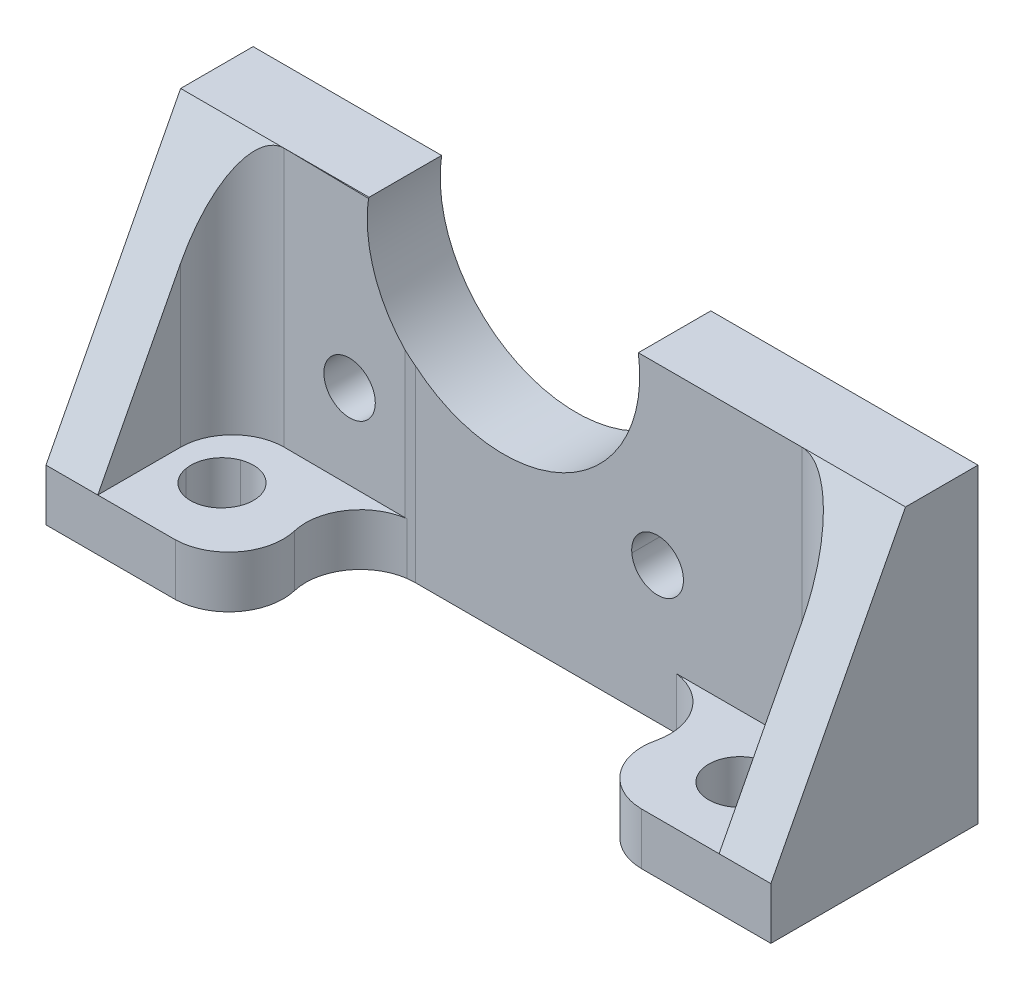
ISO-10303-21;
HEADER;
FILE_DESCRIPTION(('STEP AP214'),'2;1');
FILE_NAME('part.step','',(''),(''),'','','');
FILE_SCHEMA(('AUTOMOTIVE_DESIGN { 1 0 10303 214 1 1 1 1 }'));
ENDSEC;
DATA;
#1=APPLICATION_CONTEXT('core data for automotive mechanical design processes');
#2=APPLICATION_PROTOCOL_DEFINITION('international standard','automotive_design',2000,#1);
#3=PRODUCT_CONTEXT('',#1,'mechanical');
#4=PRODUCT('Part','Part','',(#3));
#5=PRODUCT_RELATED_PRODUCT_CATEGORY('part','',(#4));
#6=PRODUCT_DEFINITION_FORMATION('','',#4);
#7=PRODUCT_DEFINITION_CONTEXT('part definition',#1,'design');
#8=PRODUCT_DEFINITION('design','',#6,#7);
#9=PRODUCT_DEFINITION_SHAPE('','',#8);
#10=(LENGTH_UNIT() NAMED_UNIT(*) SI_UNIT(.MILLI.,.METRE.));
#11=(NAMED_UNIT(*) PLANE_ANGLE_UNIT() SI_UNIT($,.RADIAN.));
#12=(NAMED_UNIT(*) SI_UNIT($,.STERADIAN.) SOLID_ANGLE_UNIT());
#13=UNCERTAINTY_MEASURE_WITH_UNIT(LENGTH_MEASURE(1.E-05),#10,'distance_accuracy_value','');
#14=(GEOMETRIC_REPRESENTATION_CONTEXT(3) GLOBAL_UNCERTAINTY_ASSIGNED_CONTEXT((#13)) GLOBAL_UNIT_ASSIGNED_CONTEXT((#10,
#11,#12)) REPRESENTATION_CONTEXT('',''));
#15=CARTESIAN_POINT('',(0.,0.,0.));
#16=DIRECTION('',(0.,0.,1.));
#17=DIRECTION('',(1.,0.,0.));
#18=AXIS2_PLACEMENT_3D('',#15,#16,#17);
#19=CARTESIAN_POINT('',(0.534106042066399,30.,8.40733061908088));
#20=DIRECTION('',(0.0634008013396327,0.,0.997988145415311));
#21=DIRECTION('',(0.997988145415311,0.,-0.0634008013396327));
#22=AXIS2_PLACEMENT_3D('',#19,#20,#21);
#23=PLANE('',#22);
#24=DIRECTION('',(-0.997988145415311,0.,0.0634008013396327));
#25=VECTOR('',#24,1.);
#26=CARTESIAN_POINT('',(0.534106042066399,5.,8.40733061908088));
#27=LINE('',#26,#25);
#28=CARTESIAN_POINT('',(21.9298305014627,5.,7.04808994853845));
#29=VERTEX_POINT('',#28);
#30=CARTESIAN_POINT('',(21.7178268432617,5.,7.06155824661255));
#31=VERTEX_POINT('',#30);
#32=EDGE_CURVE('E165',#29,#31,#27,.T.);
#33=ORIENTED_EDGE('',*,*,#32,.F.);
#34=DIRECTION('',(0.,-1.,0.));
#35=VECTOR('',#34,1.);
#36=CARTESIAN_POINT('',(21.9298305014627,5.,7.04808994853845));
#37=LINE('',#36,#35);
#38=CARTESIAN_POINT('',(21.9298305014627,0.,7.04808994853845));
#39=VERTEX_POINT('',#38);
#40=EDGE_CURVE('E516',#29,#39,#37,.T.);
#41=ORIENTED_EDGE('',*,*,#40,.T.);
#42=DIRECTION('',(-0.997988145415311,0.,0.0634008013396327));
#43=VECTOR('',#42,1.);
#44=CARTESIAN_POINT('',(0.534106042066399,0.,8.40733061908088));
#45=LINE('',#44,#43);
#46=CARTESIAN_POINT('',(22.6868114471436,0.,7.));
#47=VERTEX_POINT('',#46);
#48=EDGE_CURVE('E474',#47,#39,#45,.T.);
#49=ORIENTED_EDGE('',*,*,#48,.F.);
#50=DIRECTION('',(0.,-1.,0.));
#51=VECTOR('',#50,1.);
#52=CARTESIAN_POINT('',(22.6868114471436,30.,7.));
#53=LINE('',#52,#51);
#54=CARTESIAN_POINT('',(22.6868114471436,18.13283074007,7.));
#55=VERTEX_POINT('',#54);
#56=EDGE_CURVE('E464',#55,#47,#53,.T.);
#57=ORIENTED_EDGE('',*,*,#56,.F.);
#58=CARTESIAN_POINT('',(31.2000007629395,28.1333333333332,6.45916890189828));
#59=DIRECTION('',(0.0634008013396327,0.,0.997988145415311));
#60=DIRECTION('',(0.997988145415311,0.,-0.0634008013396327));
#61=AXIS2_PLACEMENT_3D('',#58,#59,#60);
#62=ELLIPSE('',#61,13.1598089553137,13.1333333333333);
#63=CARTESIAN_POINT('',(21.7178268432617,19.046374425017,7.06155824661255));
#64=VERTEX_POINT('',#63);
#65=EDGE_CURVE('E441',#55,#64,#62,.F.);
#66=ORIENTED_EDGE('',*,*,#65,.T.);
#67=DIRECTION('',(0.,-1.,0.));
#68=VECTOR('',#67,1.);
#69=CARTESIAN_POINT('',(21.7178268432617,30.,7.06155824661255));
#70=LINE('',#69,#68);
#71=EDGE_CURVE('E466',#64,#31,#70,.T.);
#72=ORIENTED_EDGE('',*,*,#71,.T.);
#73=EDGE_LOOP('',(#33,#41,#49,#57,#66,#72));
#74=FACE_BOUND('',#73,.T.);
#75=ADVANCED_FACE('F142',(#74),#23,.T.);
#76=CARTESIAN_POINT('',(0.,30.,7.));
#77=DIRECTION('',(0.,0.,-1.));
#78=DIRECTION('',(-1.,0.,0.));
#79=AXIS2_PLACEMENT_3D('',#76,#77,#78);
#80=PLANE('',#79);
#81=CARTESIAN_POINT('',(46.0285189030152,13.1754530092959,7.));
#82=DIRECTION('',(0.,0.,-1.));
#83=DIRECTION('',(-1.,0.,0.));
#84=AXIS2_PLACEMENT_3D('',#81,#82,#83);
#85=CIRCLE('',#84,2.47213478677577);
#86=CARTESIAN_POINT('',(43.5682334899902,12.9336967468262,7.));
#87=VERTEX_POINT('',#86);
#88=CARTESIAN_POINT('',(45.615119934082,15.6127777099609,7.));
#89=VERTEX_POINT('',#88);
#90=EDGE_CURVE('E446',#87,#89,#85,.T.);
#91=ORIENTED_EDGE('',*,*,#90,.T.);
#92=CARTESIAN_POINT('',(46.0570988401084,13.15361720567,7.));
#93=DIRECTION('',(0.,0.,-1.));
#94=DIRECTION('',(-1.,0.,0.));
#95=AXIS2_PLACEMENT_3D('',#92,#93,#94);
#96=CIRCLE('',#95,2.49856273470104);
#97=EDGE_CURVE('E450',#87,#89,#96,.F.);
#98=ORIENTED_EDGE('',*,*,#97,.F.);
#99=EDGE_LOOP('',(#91,#98));
#100=FACE_BOUND('',#99,.T.);
#101=DIRECTION('',(0.,-1.,0.));
#102=VECTOR('',#101,1.);
#103=CARTESIAN_POINT('',(47.881000271531,5.,7.));
#104=LINE('',#103,#102);
#105=CARTESIAN_POINT('',(47.881000271531,5.,7.));
#106=VERTEX_POINT('',#105);
#107=CARTESIAN_POINT('',(47.881000271531,0.,7.));
#108=VERTEX_POINT('',#107);
#109=EDGE_CURVE('E479',#106,#108,#104,.T.);
#110=ORIENTED_EDGE('',*,*,#109,.F.);
#111=DIRECTION('',(1.,0.,0.));
#112=VECTOR('',#111,1.);
#113=CARTESIAN_POINT('',(0.,5.,7.));
#114=LINE('',#113,#112);
#115=CARTESIAN_POINT('',(60.,5.,7.));
#116=VERTEX_POINT('',#115);
#117=EDGE_CURVE('E507',#106,#116,#114,.T.);
#118=ORIENTED_EDGE('',*,*,#117,.T.);
#119=DIRECTION('',(0.,-1.,0.));
#120=VECTOR('',#119,1.);
#121=CARTESIAN_POINT('',(60.,30.,7.));
#122=LINE('',#121,#120);
#123=CARTESIAN_POINT('',(59.9999999999999,30.,7.));
#124=VERTEX_POINT('',#123);
#125=EDGE_CURVE('E461',#124,#116,#122,.T.);
#126=ORIENTED_EDGE('',*,*,#125,.F.);
#127=DIRECTION('',(1.,0.,0.));
#128=VECTOR('',#127,1.);
#129=CARTESIAN_POINT('',(-70.000025,30.,7.));
#130=LINE('',#129,#128);
#131=CARTESIAN_POINT('',(44.2000007629395,30.,7.));
#132=VERTEX_POINT('',#131);
#133=EDGE_CURVE('E360',#132,#124,#130,.T.);
#134=ORIENTED_EDGE('',*,*,#133,.F.);
#135=CARTESIAN_POINT('',(31.2000007629395,28.1333333333332,7.));
#136=DIRECTION('',(0.,0.,-1.));
#137=DIRECTION('',(-1.,0.,0.));
#138=AXIS2_PLACEMENT_3D('',#135,#136,#137);
#139=CIRCLE('',#138,13.1333333333333);
#140=EDGE_CURVE('E442',#55,#132,#139,.F.);
#141=ORIENTED_EDGE('',*,*,#140,.F.);
#142=ORIENTED_EDGE('',*,*,#56,.T.);
#143=DIRECTION('',(1.,0.,0.));
#144=VECTOR('',#143,1.);
#145=CARTESIAN_POINT('',(0.,0.,7.));
#146=LINE('',#145,#144);
#147=EDGE_CURVE('E477',#47,#108,#146,.T.);
#148=ORIENTED_EDGE('',*,*,#147,.T.);
#149=EDGE_LOOP('',(#110,#118,#126,#134,#141,#142,#148));
#150=FACE_BOUND('',#149,.T.);
#151=ADVANCED_FACE('F564',(#100,#150),#80,.F.);
#152=CARTESIAN_POINT('',(0.,0.,20.));
#153=DIRECTION('',(0.,0.,1.));
#154=DIRECTION('',(1.,0.,0.));
#155=AXIS2_PLACEMENT_3D('',#152,#153,#154);
#156=PLANE('',#155);
#157=DIRECTION('',(-1.,0.,0.));
#158=VECTOR('',#157,1.);
#159=CARTESIAN_POINT('',(0.,5.,20.));
#160=LINE('',#159,#158);
#161=CARTESIAN_POINT('',(70.,5.,20.));
#162=VERTEX_POINT('',#161);
#163=CARTESIAN_POINT('',(65.,5.,20.));
#164=VERTEX_POINT('',#163);
#165=EDGE_CURVE('E336',#162,#164,#160,.T.);
#166=ORIENTED_EDGE('',*,*,#165,.T.);
#167=DIRECTION('',(-1.,0.,0.));
#168=VECTOR('',#167,1.);
#169=CARTESIAN_POINT('',(0.,5.,20.));
#170=LINE('',#169,#168);
#171=CARTESIAN_POINT('',(57.5,5.,20.));
#172=VERTEX_POINT('',#171);
#173=EDGE_CURVE('E501',#164,#172,#170,.T.);
#174=ORIENTED_EDGE('',*,*,#173,.T.);
#175=DIRECTION('',(0.,-1.,0.));
#176=VECTOR('',#175,1.);
#177=CARTESIAN_POINT('',(57.5,5.,20.));
#178=LINE('',#177,#176);
#179=CARTESIAN_POINT('',(57.5,0.,20.));
#180=VERTEX_POINT('',#179);
#181=EDGE_CURVE('E432',#172,#180,#178,.T.);
#182=ORIENTED_EDGE('',*,*,#181,.T.);
#183=DIRECTION('',(1.,0.,0.));
#184=VECTOR('',#183,1.);
#185=CARTESIAN_POINT('',(-70.,0.,20.));
#186=LINE('',#185,#184);
#187=CARTESIAN_POINT('',(70.,0.,20.));
#188=VERTEX_POINT('',#187);
#189=EDGE_CURVE('E345',#180,#188,#186,.T.);
#190=ORIENTED_EDGE('',*,*,#189,.T.);
#191=DIRECTION('',(0.,-1.,0.));
#192=VECTOR('',#191,1.);
#193=CARTESIAN_POINT('',(70.,30.,20.));
#194=LINE('',#193,#192);
#195=EDGE_CURVE('E389',#162,#188,#194,.T.);
#196=ORIENTED_EDGE('',*,*,#195,.F.);
#197=EDGE_LOOP('',(#166,#174,#182,#190,#196));
#198=FACE_BOUND('',#197,.T.);
#199=ADVANCED_FACE('F429',(#198),#156,.T.);
#200=CARTESIAN_POINT('',(-70.,0.,20.));
#201=DIRECTION('',(0.,1.,0.));
#202=DIRECTION('',(0.,0.,1.));
#203=AXIS2_PLACEMENT_3D('',#200,#201,#202);
#204=PLANE('',#203);
#205=CARTESIAN_POINT('',(0.,0.,20.));
#206=VERTEX_POINT('',#205);
#207=CARTESIAN_POINT('',(12.5,0.,20.));
#208=VERTEX_POINT('',#207);
#209=EDGE_CURVE('E327',#206,#208,#186,.T.);
#210=ORIENTED_EDGE('',*,*,#209,.F.);
#211=DIRECTION('',(0.,0.,-1.));
#212=VECTOR('',#211,1.);
#213=CARTESIAN_POINT('',(0.,0.,0.));
#214=LINE('',#213,#212);
#215=CARTESIAN_POINT('',(0.,0.,0.));
#216=VERTEX_POINT('',#215);
#217=EDGE_CURVE('E313',#206,#216,#214,.T.);
#218=ORIENTED_EDGE('',*,*,#217,.T.);
#219=DIRECTION('',(1.,0.,0.));
#220=VECTOR('',#219,1.);
#221=CARTESIAN_POINT('',(-70.,0.,0.));
#222=LINE('',#221,#220);
#223=CARTESIAN_POINT('',(70.,0.,0.));
#224=VERTEX_POINT('',#223);
#225=EDGE_CURVE('E324',#216,#224,#222,.T.);
#226=ORIENTED_EDGE('',*,*,#225,.T.);
#227=DIRECTION('',(0.,0.,-1.));
#228=VECTOR('',#227,1.);
#229=CARTESIAN_POINT('',(70.,0.,20.));
#230=LINE('',#229,#228);
#231=EDGE_CURVE('E392',#188,#224,#230,.T.);
#232=ORIENTED_EDGE('',*,*,#231,.F.);
#233=ORIENTED_EDGE('',*,*,#189,.F.);
#234=CARTESIAN_POINT('',(57.574976583864,0.,14.7692487816431));
#235=DIRECTION('',(0.,1.,0.));
#236=DIRECTION('',(0.,0.,1.));
#237=AXIS2_PLACEMENT_3D('',#234,#235,#236);
#238=CIRCLE('',#237,5.23128854073932);
#239=CARTESIAN_POINT('',(52.5,0.,13.5));
#240=VERTEX_POINT('',#239);
#241=EDGE_CURVE('E491',#240,#180,#238,.T.);
#242=ORIENTED_EDGE('',*,*,#241,.F.);
#243=CARTESIAN_POINT('',(47.1821821883778,0.,12.3877568895588));
#244=DIRECTION('',(0.,1.,0.));
#245=DIRECTION('',(0.,0.,1.));
#246=AXIS2_PLACEMENT_3D('',#243,#244,#245);
#247=CIRCLE('',#246,5.43288790739604);
#248=EDGE_CURVE('E493',#108,#240,#247,.F.);
#249=ORIENTED_EDGE('',*,*,#248,.F.);
#250=ORIENTED_EDGE('',*,*,#147,.F.);
#251=ORIENTED_EDGE('',*,*,#48,.T.);
#252=CARTESIAN_POINT('',(22.6424843846735,0.,12.2840908275495));
#253=DIRECTION('',(0.,1.,0.));
#254=DIRECTION('',(0.,0.,1.));
#255=AXIS2_PLACEMENT_3D('',#252,#253,#254);
#256=CIRCLE('',#255,5.28427674921176);
#257=CARTESIAN_POINT('',(17.5,0.,13.5));
#258=VERTEX_POINT('',#257);
#259=EDGE_CURVE('E534',#258,#39,#256,.F.);
#260=ORIENTED_EDGE('',*,*,#259,.F.);
#261=CARTESIAN_POINT('',(12.3741517704379,0.,14.7301167464907));
#262=DIRECTION('',(0.,1.,0.));
#263=DIRECTION('',(0.,0.,1.));
#264=AXIS2_PLACEMENT_3D('',#261,#262,#263);
#265=CIRCLE('',#264,5.27138570799956);
#266=EDGE_CURVE('E537',#208,#258,#265,.T.);
#267=ORIENTED_EDGE('',*,*,#266,.F.);
#268=EDGE_LOOP('',(#210,#218,#226,#232,#233,#242,#249,#250,#251,#260,#267));
#269=FACE_BOUND('',#268,.T.);
#270=CARTESIAN_POINT('',(59.9999994438134,0.,13.0000008825573));
#271=DIRECTION('',(0.,1.,0.));
#272=DIRECTION('',(0.,0.,1.));
#273=AXIS2_PLACEMENT_3D('',#270,#271,#272);
#274=CIRCLE('',#273,3.00000016436178);
#275=CARTESIAN_POINT('',(59.9999994438134,0.,16.0000010469191));
#276=VERTEX_POINT('',#275);
#277=EDGE_CURVE('E487',#276,#276,#274,.T.);
#278=ORIENTED_EDGE('',*,*,#277,.T.);
#279=EDGE_LOOP('',(#278));
#280=FACE_BOUND('',#279,.T.);
#281=CARTESIAN_POINT('',(9.99999884936972,0.,12.9999991925577));
#282=DIRECTION('',(0.,1.,0.));
#283=DIRECTION('',(0.,0.,1.));
#284=AXIS2_PLACEMENT_3D('',#281,#282,#283);
#285=CIRCLE('',#284,2.99999871427768);
#286=CARTESIAN_POINT('',(8.97393894195557,0.,10.1809225082397));
#287=VERTEX_POINT('',#286);
#288=CARTESIAN_POINT('',(7.04557704925537,0.,13.5209445953369));
#289=VERTEX_POINT('',#288);
#290=EDGE_CURVE('E531',#287,#289,#285,.T.);
#291=ORIENTED_EDGE('',*,*,#290,.T.);
#292=CARTESIAN_POINT('',(9.95507838710774,0.,13.0449227531186));
#293=DIRECTION('',(0.,1.,0.));
#294=DIRECTION('',(0.,0.,1.));
#295=AXIS2_PLACEMENT_3D('',#292,#293,#294);
#296=CIRCLE('',#295,2.94818500593733);
#297=CARTESIAN_POINT('',(12.3741517704379,0.,14.7301167464907));
#298=VERTEX_POINT('',#297);
#299=EDGE_CURVE('E524',#298,#289,#296,.F.);
#300=ORIENTED_EDGE('',*,*,#299,.F.);
#301=CARTESIAN_POINT('',(10.0203380297134,0.,12.9441213271765));
#302=DIRECTION('',(0.,1.,0.));
#303=DIRECTION('',(0.,0.,1.));
#304=AXIS2_PLACEMENT_3D('',#301,#302,#303);
#305=CIRCLE('',#304,2.95469436047693);
#306=EDGE_CURVE('E528',#287,#298,#305,.F.);
#307=ORIENTED_EDGE('',*,*,#306,.F.);
#308=EDGE_LOOP('',(#291,#300,#307));
#309=FACE_BOUND('',#308,.T.);
#310=ADVANCED_FACE('F144',(#269,#280,#309),#204,.F.);
#311=CARTESIAN_POINT('',(0.,9.25062972292192,17.7896725440806));
#312=DIRECTION('',(0.,-0.46135273664199,-0.887216801234595));
#313=DIRECTION('',(0.,0.887216801234595,-0.46135273664199));
#314=AXIS2_PLACEMENT_3D('',#311,#312,#313);
#315=PLANE('',#314);
#316=DIRECTION('',(0.,0.887216801234595,-0.46135273664199));
#317=VECTOR('',#316,1.);
#318=CARTESIAN_POINT('',(65.,9.25062972292192,17.7896725440806));
#319=LINE('',#318,#317);
#320=CARTESIAN_POINT('',(65.,20.3846153846154,12.));
#321=VERTEX_POINT('',#320);
#322=EDGE_CURVE('E12',#164,#321,#319,.T.);
#323=ORIENTED_EDGE('',*,*,#322,.F.);
#324=ORIENTED_EDGE('',*,*,#165,.F.);
#325=DIRECTION('',(0.,-0.887216801234595,0.46135273664199));
#326=VECTOR('',#325,1.);
#327=CARTESIAN_POINT('',(70.,9.25062972292192,17.7896725440806));
#328=LINE('',#327,#326);
#329=CARTESIAN_POINT('',(70.,30.,7.));
#330=VERTEX_POINT('',#329);
#331=EDGE_CURVE('E361',#330,#162,#328,.T.);
#332=ORIENTED_EDGE('',*,*,#331,.F.);
#333=EDGE_CURVE('E357',#124,#330,#130,.T.);
#334=ORIENTED_EDGE('',*,*,#333,.F.);
#335=CARTESIAN_POINT('',(60.,20.3846153846154,12.));
#336=DIRECTION('',(0.,-0.46135273664199,-0.887216801234595));
#337=DIRECTION('',(0.,-0.887216801234595,0.46135273664199));
#338=AXIS2_PLACEMENT_3D('',#335,#336,#337);
#339=ELLIPSE('',#338,10.8376944643119,5.00000000000001);
#340=EDGE_CURVE('E150',#124,#321,#339,.T.);
#341=ORIENTED_EDGE('',*,*,#340,.T.);
#342=EDGE_LOOP('',(#323,#324,#332,#334,#341));
#343=FACE_BOUND('',#342,.T.);
#344=ADVANCED_FACE('F586',(#343),#315,.F.);
#345=DIRECTION('',(-1.,0.,0.));
#346=VECTOR('',#345,1.);
#347=CARTESIAN_POINT('',(0.,30.,7.));
#348=LINE('',#347,#346);
#349=CARTESIAN_POINT('',(18.2000007629394,30.,7.));
#350=VERTEX_POINT('',#349);
#351=CARTESIAN_POINT('',(10.,30.,7.));
#352=VERTEX_POINT('',#351);
#353=EDGE_CURVE('E349',#350,#352,#348,.T.);
#354=ORIENTED_EDGE('',*,*,#353,.T.);
#355=DIRECTION('',(0.999935175391693,-0.0101020070573921,0.00525304366984392));
#356=VECTOR('',#355,1.);
#357=CARTESIAN_POINT('',(0.267568094102676,30.0983234695794,6.94887179581873));
#358=LINE('',#357,#356);
#359=CARTESIAN_POINT('',(18.1883907569981,29.917275456198,7.04301676277706));
#360=VERTEX_POINT('',#359);
#361=EDGE_CURVE('E410',#352,#360,#358,.T.);
#362=ORIENTED_EDGE('',*,*,#361,.T.);
#363=CARTESIAN_POINT('',(31.2000007629395,28.1333333333332,7.97066666666673));
#364=DIRECTION('',(0.,0.46135273664199,0.887216801234595));
#365=DIRECTION('',(0.,0.887216801234595,-0.46135273664199));
#366=AXIS2_PLACEMENT_3D('',#363,#364,#365);
#367=ELLIPSE('',#366,14.8028456123214,13.1333333333333);
#368=EDGE_CURVE('E371',#360,#350,#367,.F.);
#369=ORIENTED_EDGE('',*,*,#368,.T.);
#370=EDGE_LOOP('',(#354,#362,#369));
#371=FACE_BOUND('',#370,.T.);
#372=ADVANCED_FACE('F409',(#371),#315,.F.);
#373=DIRECTION('',(0.,-1.,0.));
#374=VECTOR('',#373,1.);
#375=CARTESIAN_POINT('',(0.,0.,20.));
#376=LINE('',#375,#374);
#377=CARTESIAN_POINT('',(0.,5.,20.));
#378=VERTEX_POINT('',#377);
#379=EDGE_CURVE('E157',#378,#206,#376,.T.);
#380=ORIENTED_EDGE('',*,*,#379,.T.);
#381=ORIENTED_EDGE('',*,*,#209,.T.);
#382=DIRECTION('',(0.,-1.,0.));
#383=VECTOR('',#382,1.);
#384=CARTESIAN_POINT('',(12.5,5.,20.));
#385=LINE('',#384,#383);
#386=CARTESIAN_POINT('',(12.5,5.,20.));
#387=VERTEX_POINT('',#386);
#388=EDGE_CURVE('E510',#387,#208,#385,.T.);
#389=ORIENTED_EDGE('',*,*,#388,.F.);
#390=DIRECTION('',(1.,0.,0.));
#391=VECTOR('',#390,1.);
#392=CARTESIAN_POINT('',(0.,5.,20.));
#393=LINE('',#392,#391);
#394=CARTESIAN_POINT('',(5.,5.,20.));
#395=VERTEX_POINT('',#394);
#396=EDGE_CURVE('E553',#395,#387,#393,.T.);
#397=ORIENTED_EDGE('',*,*,#396,.F.);
#398=EDGE_CURVE('E341',#395,#378,#160,.T.);
#399=ORIENTED_EDGE('',*,*,#398,.T.);
#400=EDGE_LOOP('',(#380,#381,#389,#397,#399));
#401=FACE_BOUND('',#400,.T.);
#402=ADVANCED_FACE('F594',(#401),#156,.T.);
#403=CARTESIAN_POINT('',(-70.,30.,20.));
#404=DIRECTION('',(0.,1.,0.));
#405=DIRECTION('',(0.,0.,1.));
#406=AXIS2_PLACEMENT_3D('',#403,#404,#405);
#407=PLANE('',#406);
#408=DIRECTION('',(0.,0.,-1.));
#409=VECTOR('',#408,1.);
#410=CARTESIAN_POINT('',(44.2000007629395,30.,20.00005));
#411=LINE('',#410,#409);
#412=CARTESIAN_POINT('',(44.2000007629395,30.,0.));
#413=VERTEX_POINT('',#412);
#414=EDGE_CURVE('E356',#132,#413,#411,.T.);
#415=ORIENTED_EDGE('',*,*,#414,.F.);
#416=ORIENTED_EDGE('',*,*,#133,.T.);
#417=ORIENTED_EDGE('',*,*,#333,.T.);
#418=DIRECTION('',(0.,0.,-1.));
#419=VECTOR('',#418,1.);
#420=CARTESIAN_POINT('',(70.,30.,20.));
#421=LINE('',#420,#419);
#422=CARTESIAN_POINT('',(70.,30.,0.));
#423=VERTEX_POINT('',#422);
#424=EDGE_CURVE('E395',#330,#423,#421,.T.);
#425=ORIENTED_EDGE('',*,*,#424,.T.);
#426=DIRECTION('',(1.,0.,0.));
#427=VECTOR('',#426,1.);
#428=CARTESIAN_POINT('',(-70.,30.,0.));
#429=LINE('',#428,#427);
#430=EDGE_CURVE('E335',#413,#423,#429,.T.);
#431=ORIENTED_EDGE('',*,*,#430,.F.);
#432=EDGE_LOOP('',(#415,#416,#417,#425,#431));
#433=FACE_BOUND('',#432,.T.);
#434=ADVANCED_FACE('F562',(#433),#407,.T.);
#435=DIRECTION('',(0.,0.,1.));
#436=VECTOR('',#435,1.);
#437=CARTESIAN_POINT('',(0.,30.,0.));
#438=LINE('',#437,#436);
#439=CARTESIAN_POINT('',(0.,30.,0.));
#440=VERTEX_POINT('',#439);
#441=CARTESIAN_POINT('',(0.,30.,7.));
#442=VERTEX_POINT('',#441);
#443=EDGE_CURVE('E315',#440,#442,#438,.T.);
#444=ORIENTED_EDGE('',*,*,#443,.T.);
#445=EDGE_CURVE('E362',#352,#442,#348,.T.);
#446=ORIENTED_EDGE('',*,*,#445,.F.);
#447=ORIENTED_EDGE('',*,*,#353,.F.);
#448=DIRECTION('',(0.,0.,-1.));
#449=VECTOR('',#448,1.);
#450=CARTESIAN_POINT('',(18.2000007629395,30.,20.00005));
#451=LINE('',#450,#449);
#452=CARTESIAN_POINT('',(18.2000007629395,30.,0.));
#453=VERTEX_POINT('',#452);
#454=EDGE_CURVE('E416',#453,#350,#451,.F.);
#455=ORIENTED_EDGE('',*,*,#454,.F.);
#456=EDGE_CURVE('E338',#440,#453,#429,.T.);
#457=ORIENTED_EDGE('',*,*,#456,.F.);
#458=EDGE_LOOP('',(#444,#446,#447,#455,#457));
#459=FACE_BOUND('',#458,.T.);
#460=ADVANCED_FACE('F415',(#459),#407,.T.);
#461=CARTESIAN_POINT('',(70.,30.,20.));
#462=DIRECTION('',(1.,0.,0.));
#463=DIRECTION('',(0.,0.,-1.));
#464=AXIS2_PLACEMENT_3D('',#461,#462,#463);
#465=PLANE('',#464);
#466=ORIENTED_EDGE('',*,*,#424,.F.);
#467=ORIENTED_EDGE('',*,*,#331,.T.);
#468=ORIENTED_EDGE('',*,*,#195,.T.);
#469=ORIENTED_EDGE('',*,*,#231,.T.);
#470=DIRECTION('',(0.,-1.,0.));
#471=VECTOR('',#470,1.);
#472=CARTESIAN_POINT('',(70.,30.,0.));
#473=LINE('',#472,#471);
#474=EDGE_CURVE('E334',#423,#224,#473,.T.);
#475=ORIENTED_EDGE('',*,*,#474,.F.);
#476=EDGE_LOOP('',(#466,#467,#468,#469,#475));
#477=FACE_BOUND('',#476,.T.);
#478=ADVANCED_FACE('F437',(#477),#465,.T.);
#479=CARTESIAN_POINT('',(31.2000007629395,28.1333333333332,20.00005));
#480=DIRECTION('',(0.,0.,-1.));
#481=DIRECTION('',(-1.,0.,0.));
#482=AXIS2_PLACEMENT_3D('',#479,#480,#481);
#483=CYLINDRICAL_SURFACE('',#482,13.1333333333333);
#484=ORIENTED_EDGE('',*,*,#65,.F.);
#485=ORIENTED_EDGE('',*,*,#140,.T.);
#486=ORIENTED_EDGE('',*,*,#414,.T.);
#487=CARTESIAN_POINT('',(31.2000007629395,28.1333333333332,0.));
#488=DIRECTION('',(0.,0.,-1.));
#489=DIRECTION('',(-1.,0.,0.));
#490=AXIS2_PLACEMENT_3D('',#487,#488,#489);
#491=CIRCLE('',#490,13.1333333333333);
#492=EDGE_CURVE('E386',#413,#453,#491,.T.);
#493=ORIENTED_EDGE('',*,*,#492,.T.);
#494=ORIENTED_EDGE('',*,*,#454,.T.);
#495=ORIENTED_EDGE('',*,*,#368,.F.);
#496=CARTESIAN_POINT('',(31.2000007629395,28.1333333333332,7.11137174943848));
#497=DIRECTION('',(0.00525331172834961,0.,-0.99998620126274));
#498=DIRECTION('',(-0.99998620126274,0.,-0.00525331172834961));
#499=AXIS2_PLACEMENT_3D('',#496,#497,#498);
#500=ELLIPSE('',#499,13.1335145592501,13.1333333333333);
#501=EDGE_CURVE('E456',#360,#64,#500,.F.);
#502=ORIENTED_EDGE('',*,*,#501,.T.);
#503=EDGE_LOOP('',(#484,#485,#486,#493,#494,#495,#502));
#504=FACE_BOUND('',#503,.T.);
#505=ADVANCED_FACE('F419',(#504),#483,.F.);
#506=CARTESIAN_POINT('',(16.3479534512525,13.1430530786648,20.00005));
#507=DIRECTION('',(0.,0.,-1.));
#508=DIRECTION('',(-1.,0.,0.));
#509=AXIS2_PLACEMENT_3D('',#506,#507,#508);
#510=CYLINDRICAL_SURFACE('',#509,2.49720773525104);
#511=CARTESIAN_POINT('',(16.3479534512525,13.1430530786648,7.03334823848007));
#512=DIRECTION('',(0.00525331172834961,0.,-0.99998620126274));
#513=DIRECTION('',(-0.99998620126274,0.,-0.00525331172834961));
#514=AXIS2_PLACEMENT_3D('',#511,#512,#513);
#515=ELLIPSE('',#514,2.49724219403995,2.49720773525104);
#516=CARTESIAN_POINT('',(13.8507457160014,13.1430530786648,7.02022944677359));
#517=VERTEX_POINT('',#516);
#518=EDGE_CURVE('E453',#517,#517,#515,.T.);
#519=ORIENTED_EDGE('',*,*,#518,.F.);
#520=EDGE_LOOP('',(#519));
#521=FACE_BOUND('',#520,.T.);
#522=CARTESIAN_POINT('',(16.3479534512525,13.1430530786648,0.));
#523=DIRECTION('',(0.,0.,-1.));
#524=DIRECTION('',(-1.,0.,0.));
#525=AXIS2_PLACEMENT_3D('',#522,#523,#524);
#526=CIRCLE('',#525,2.49720773525104);
#527=CARTESIAN_POINT('',(13.8507457160014,13.1430530786648,0.));
#528=VERTEX_POINT('',#527);
#529=EDGE_CURVE('E383',#528,#528,#526,.F.);
#530=ORIENTED_EDGE('',*,*,#529,.F.);
#531=EDGE_LOOP('',(#530));
#532=FACE_BOUND('',#531,.T.);
#533=ADVANCED_FACE('F622',(#521,#532),#510,.F.);
#534=CARTESIAN_POINT('',(46.0285189030152,13.1754530092959,20.00005));
#535=DIRECTION('',(0.,0.,-1.));
#536=DIRECTION('',(-1.,0.,0.));
#537=AXIS2_PLACEMENT_3D('',#534,#535,#536);
#538=CYLINDRICAL_SURFACE('',#537,2.47213478677577);
#539=ORIENTED_EDGE('',*,*,#90,.F.);
#540=DIRECTION('',(0.,0.,-1.));
#541=VECTOR('',#540,1.);
#542=CARTESIAN_POINT('',(43.5682334899902,12.9336967468262,20.00005));
#543=LINE('',#542,#541);
#544=CARTESIAN_POINT('',(43.5682334899902,12.9336967468262,0.));
#545=VERTEX_POINT('',#544);
#546=EDGE_CURVE('E381',#87,#545,#543,.T.);
#547=ORIENTED_EDGE('',*,*,#546,.T.);
#548=CARTESIAN_POINT('',(46.0285189030152,13.1754530092959,0.));
#549=DIRECTION('',(0.,0.,-1.));
#550=DIRECTION('',(-1.,0.,0.));
#551=AXIS2_PLACEMENT_3D('',#548,#549,#550);
#552=CIRCLE('',#551,2.47213478677577);
#553=CARTESIAN_POINT('',(45.615119934082,15.6127777099609,0.));
#554=VERTEX_POINT('',#553);
#555=EDGE_CURVE('E373',#554,#545,#552,.F.);
#556=ORIENTED_EDGE('',*,*,#555,.F.);
#557=DIRECTION('',(0.,0.,-1.));
#558=VECTOR('',#557,1.);
#559=CARTESIAN_POINT('',(45.615119934082,15.6127777099609,20.00005));
#560=LINE('',#559,#558);
#561=EDGE_CURVE('E379',#89,#554,#560,.T.);
#562=ORIENTED_EDGE('',*,*,#561,.F.);
#563=EDGE_LOOP('',(#539,#547,#556,#562));
#564=FACE_BOUND('',#563,.T.);
#565=ADVANCED_FACE('F618',(#564),#538,.F.);
#566=CARTESIAN_POINT('',(46.0570988401084,13.15361720567,20.00005));
#567=DIRECTION('',(0.,0.,-1.));
#568=DIRECTION('',(-1.,0.,0.));
#569=AXIS2_PLACEMENT_3D('',#566,#567,#568);
#570=CYLINDRICAL_SURFACE('',#569,2.49856273470104);
#571=ORIENTED_EDGE('',*,*,#546,.F.);
#572=ORIENTED_EDGE('',*,*,#97,.T.);
#573=ORIENTED_EDGE('',*,*,#561,.T.);
#574=CARTESIAN_POINT('',(46.0570988401084,13.15361720567,0.));
#575=DIRECTION('',(0.,0.,-1.));
#576=DIRECTION('',(-1.,0.,0.));
#577=AXIS2_PLACEMENT_3D('',#574,#575,#576);
#578=CIRCLE('',#577,2.49856273470104);
#579=EDGE_CURVE('E376',#554,#545,#578,.T.);
#580=ORIENTED_EDGE('',*,*,#579,.T.);
#581=EDGE_LOOP('',(#571,#572,#573,#580));
#582=FACE_BOUND('',#581,.T.);
#583=ADVANCED_FACE('F615',(#582),#570,.F.);
#584=CARTESIAN_POINT('',(0.,0.,0.));
#585=DIRECTION('',(0.,0.,1.));
#586=DIRECTION('',(1.,0.,0.));
#587=AXIS2_PLACEMENT_3D('',#584,#585,#586);
#588=PLANE('',#587);
#589=ORIENTED_EDGE('',*,*,#225,.F.);
#590=DIRECTION('',(0.,1.,0.));
#591=VECTOR('',#590,1.);
#592=CARTESIAN_POINT('',(0.,0.,0.));
#593=LINE('',#592,#591);
#594=EDGE_CURVE('E310',#216,#440,#593,.T.);
#595=ORIENTED_EDGE('',*,*,#594,.T.);
#596=ORIENTED_EDGE('',*,*,#456,.T.);
#597=ORIENTED_EDGE('',*,*,#492,.F.);
#598=ORIENTED_EDGE('',*,*,#430,.T.);
#599=ORIENTED_EDGE('',*,*,#474,.T.);
#600=EDGE_LOOP('',(#589,#595,#596,#597,#598,#599));
#601=FACE_BOUND('',#600,.T.);
#602=ORIENTED_EDGE('',*,*,#529,.T.);
#603=EDGE_LOOP('',(#602));
#604=FACE_BOUND('',#603,.T.);
#605=ORIENTED_EDGE('',*,*,#555,.T.);
#606=ORIENTED_EDGE('',*,*,#579,.F.);
#607=EDGE_LOOP('',(#605,#606));
#608=FACE_BOUND('',#607,.T.);
#609=ADVANCED_FACE('F330',(#601,#604,#608),#588,.F.);
#610=ORIENTED_EDGE('',*,*,#445,.T.);
#611=DIRECTION('',(0.,-0.887216801234595,0.46135273664199));
#612=VECTOR('',#611,1.);
#613=CARTESIAN_POINT('',(0.,9.25062972292192,17.7896725440806));
#614=LINE('',#613,#612);
#615=EDGE_CURVE('E559',#442,#378,#614,.T.);
#616=ORIENTED_EDGE('',*,*,#615,.T.);
#617=ORIENTED_EDGE('',*,*,#398,.F.);
#618=DIRECTION('',(0.,0.887216801234595,-0.46135273664199));
#619=VECTOR('',#618,1.);
#620=CARTESIAN_POINT('',(5.,9.25062972292192,17.7896725440806));
#621=LINE('',#620,#619);
#622=CARTESIAN_POINT('',(5.,20.3846156433825,11.9999998654411));
#623=VERTEX_POINT('',#622);
#624=EDGE_CURVE('E422',#395,#623,#621,.T.);
#625=ORIENTED_EDGE('',*,*,#624,.T.);
#626=CARTESIAN_POINT('',(9.9999998654411,20.3846156433825,11.9999998654411));
#627=DIRECTION('',(0.,-0.46135273664199,-0.887216801234595));
#628=DIRECTION('',(0.,-0.887216801234595,0.46135273664199));
#629=AXIS2_PLACEMENT_3D('',#626,#627,#628);
#630=ELLIPSE('',#629,10.8376941726502,4.99999986544111);
#631=EDGE_CURVE('E905',#623,#352,#630,.T.);
#632=ORIENTED_EDGE('',*,*,#631,.T.);
#633=EDGE_LOOP('',(#610,#616,#617,#625,#632));
#634=FACE_BOUND('',#633,.T.);
#635=ADVANCED_FACE('F589',(#634),#315,.F.);
#636=CARTESIAN_POINT('',(65.,30.,0.));
#637=DIRECTION('',(-1.,0.,0.));
#638=DIRECTION('',(0.,0.,1.));
#639=AXIS2_PLACEMENT_3D('',#636,#637,#638);
#640=PLANE('',#639);
#641=DIRECTION('',(0.,0.,-1.));
#642=VECTOR('',#641,1.);
#643=CARTESIAN_POINT('',(65.,5.,0.));
#644=LINE('',#643,#642);
#645=CARTESIAN_POINT('',(65.,5.,12.));
#646=VERTEX_POINT('',#645);
#647=EDGE_CURVE('E498',#164,#646,#644,.T.);
#648=ORIENTED_EDGE('',*,*,#647,.F.);
#649=ORIENTED_EDGE('',*,*,#322,.T.);
#650=DIRECTION('',(0.,-1.,0.));
#651=VECTOR('',#650,1.);
#652=CARTESIAN_POINT('',(65.,30.,12.));
#653=LINE('',#652,#651);
#654=EDGE_CURVE('E458',#321,#646,#653,.T.);
#655=ORIENTED_EDGE('',*,*,#654,.T.);
#656=EDGE_LOOP('',(#648,#649,#655));
#657=FACE_BOUND('',#656,.T.);
#658=ADVANCED_FACE('F598',(#657),#640,.T.);
#659=CARTESIAN_POINT('',(60.,30.,12.));
#660=DIRECTION('',(0.,-1.,0.));
#661=DIRECTION('',(0.,0.,-1.));
#662=AXIS2_PLACEMENT_3D('',#659,#660,#661);
#663=CYLINDRICAL_SURFACE('',#662,5.00000000000001);
#664=ORIENTED_EDGE('',*,*,#125,.T.);
#665=CARTESIAN_POINT('',(60.,5.,12.));
#666=DIRECTION('',(0.,1.,0.));
#667=DIRECTION('',(0.,0.,1.));
#668=AXIS2_PLACEMENT_3D('',#665,#666,#667);
#669=CIRCLE('',#668,5.00000000000001);
#670=EDGE_CURVE('E490',#116,#646,#669,.F.);
#671=ORIENTED_EDGE('',*,*,#670,.T.);
#672=ORIENTED_EDGE('',*,*,#654,.F.);
#673=ORIENTED_EDGE('',*,*,#340,.F.);
#674=EDGE_LOOP('',(#664,#671,#672,#673));
#675=FACE_BOUND('',#674,.T.);
#676=ADVANCED_FACE('F582',(#675),#663,.F.);
#677=CARTESIAN_POINT('',(-0.0364967018338171,30.,6.94727442661838));
#678=DIRECTION('',(0.00525331172834961,0.,-0.99998620126274));
#679=DIRECTION('',(-0.99998620126274,0.,-0.00525331172834961));
#680=AXIS2_PLACEMENT_3D('',#677,#678,#679);
#681=PLANE('',#680);
#682=ORIENTED_EDGE('',*,*,#518,.T.);
#683=EDGE_LOOP('',(#682));
#684=FACE_BOUND('',#683,.T.);
#685=DIRECTION('',(0.,-1.,0.));
#686=VECTOR('',#685,1.);
#687=CARTESIAN_POINT('',(10.,30.,7.));
#688=LINE('',#687,#686);
#689=CARTESIAN_POINT('',(10.,5.,7.));
#690=VERTEX_POINT('',#689);
#691=EDGE_CURVE('E468',#352,#690,#688,.T.);
#692=ORIENTED_EDGE('',*,*,#691,.T.);
#693=DIRECTION('',(0.99998620126274,0.,0.00525331172834961));
#694=VECTOR('',#693,1.);
#695=CARTESIAN_POINT('',(-0.0364967018338171,5.,6.94727442661838));
#696=LINE('',#695,#694);
#697=EDGE_CURVE('E546',#690,#31,#696,.T.);
#698=ORIENTED_EDGE('',*,*,#697,.T.);
#699=ORIENTED_EDGE('',*,*,#71,.F.);
#700=ORIENTED_EDGE('',*,*,#501,.F.);
#701=ORIENTED_EDGE('',*,*,#361,.F.);
#702=EDGE_LOOP('',(#692,#698,#699,#700,#701));
#703=FACE_BOUND('',#702,.T.);
#704=ADVANCED_FACE('F607',(#684,#703),#681,.F.);
#705=CARTESIAN_POINT('',(9.9999998654411,30.,11.9999998654411));
#706=DIRECTION('',(0.,-1.,0.));
#707=DIRECTION('',(0.,0.,-1.));
#708=AXIS2_PLACEMENT_3D('',#705,#706,#707);
#709=CYLINDRICAL_SURFACE('',#708,4.99999986544111);
#710=DIRECTION('',(0.,-1.,0.));
#711=VECTOR('',#710,1.);
#712=CARTESIAN_POINT('',(5.,30.,11.9999998654411));
#713=LINE('',#712,#711);
#714=CARTESIAN_POINT('',(5.,5.,11.9999998654411));
#715=VERTEX_POINT('',#714);
#716=EDGE_CURVE('E471',#623,#715,#713,.T.);
#717=ORIENTED_EDGE('',*,*,#716,.T.);
#718=CARTESIAN_POINT('',(9.9999998654411,5.,11.9999998654411));
#719=DIRECTION('',(0.,1.,0.));
#720=DIRECTION('',(0.,0.,1.));
#721=AXIS2_PLACEMENT_3D('',#718,#719,#720);
#722=CIRCLE('',#721,4.99999986544111);
#723=EDGE_CURVE('E527',#715,#690,#722,.F.);
#724=ORIENTED_EDGE('',*,*,#723,.T.);
#725=ORIENTED_EDGE('',*,*,#691,.F.);
#726=ORIENTED_EDGE('',*,*,#631,.F.);
#727=EDGE_LOOP('',(#717,#724,#725,#726));
#728=FACE_BOUND('',#727,.T.);
#729=ADVANCED_FACE('F770',(#728),#709,.F.);
#730=CARTESIAN_POINT('',(5.,30.,0.));
#731=DIRECTION('',(-1.,0.,0.));
#732=DIRECTION('',(0.,0.,1.));
#733=AXIS2_PLACEMENT_3D('',#730,#731,#732);
#734=PLANE('',#733);
#735=ORIENTED_EDGE('',*,*,#624,.F.);
#736=DIRECTION('',(0.,0.,-1.));
#737=VECTOR('',#736,1.);
#738=CARTESIAN_POINT('',(5.,5.,0.));
#739=LINE('',#738,#737);
#740=EDGE_CURVE('E555',#395,#715,#739,.T.);
#741=ORIENTED_EDGE('',*,*,#740,.T.);
#742=ORIENTED_EDGE('',*,*,#716,.F.);
#743=EDGE_LOOP('',(#735,#741,#742));
#744=FACE_BOUND('',#743,.T.);
#745=ADVANCED_FACE('F764',(#744),#734,.F.);
#746=CARTESIAN_POINT('',(47.1821821883778,5.,12.3877568895588));
#747=DIRECTION('',(0.,-1.,0.));
#748=DIRECTION('',(0.,0.,-1.));
#749=AXIS2_PLACEMENT_3D('',#746,#747,#748);
#750=CYLINDRICAL_SURFACE('',#749,5.43288790739604);
#751=ORIENTED_EDGE('',*,*,#248,.T.);
#752=DIRECTION('',(0.,-1.,0.));
#753=VECTOR('',#752,1.);
#754=CARTESIAN_POINT('',(52.5,5.,13.5));
#755=LINE('',#754,#753);
#756=CARTESIAN_POINT('',(52.5,5.,13.5));
#757=VERTEX_POINT('',#756);
#758=EDGE_CURVE('E482',#757,#240,#755,.T.);
#759=ORIENTED_EDGE('',*,*,#758,.F.);
#760=CARTESIAN_POINT('',(47.1821821883778,5.,12.3877568895588));
#761=DIRECTION('',(0.,1.,0.));
#762=DIRECTION('',(0.,0.,1.));
#763=AXIS2_PLACEMENT_3D('',#760,#761,#762);
#764=CIRCLE('',#763,5.43288790739604);
#765=EDGE_CURVE('E505',#106,#757,#764,.F.);
#766=ORIENTED_EDGE('',*,*,#765,.F.);
#767=ORIENTED_EDGE('',*,*,#109,.T.);
#768=EDGE_LOOP('',(#751,#759,#766,#767));
#769=FACE_BOUND('',#768,.T.);
#770=ADVANCED_FACE('F572',(#769),#750,.F.);
#771=CARTESIAN_POINT('',(57.574976583864,5.,14.7692487816431));
#772=DIRECTION('',(0.,-1.,0.));
#773=DIRECTION('',(0.,0.,-1.));
#774=AXIS2_PLACEMENT_3D('',#771,#772,#773);
#775=CYLINDRICAL_SURFACE('',#774,5.23128854073932);
#776=ORIENTED_EDGE('',*,*,#241,.T.);
#777=ORIENTED_EDGE('',*,*,#181,.F.);
#778=CARTESIAN_POINT('',(57.574976583864,5.,14.7692487816431));
#779=DIRECTION('',(0.,1.,0.));
#780=DIRECTION('',(0.,0.,1.));
#781=AXIS2_PLACEMENT_3D('',#778,#779,#780);
#782=CIRCLE('',#781,5.23128854073932);
#783=EDGE_CURVE('E503',#757,#172,#782,.T.);
#784=ORIENTED_EDGE('',*,*,#783,.F.);
#785=ORIENTED_EDGE('',*,*,#758,.T.);
#786=EDGE_LOOP('',(#776,#777,#784,#785));
#787=FACE_BOUND('',#786,.T.);
#788=ADVANCED_FACE('F749',(#787),#775,.T.);
#789=CARTESIAN_POINT('',(59.9999994438134,5.,13.0000008825573));
#790=DIRECTION('',(0.,-1.,0.));
#791=DIRECTION('',(0.,0.,-1.));
#792=AXIS2_PLACEMENT_3D('',#789,#790,#791);
#793=CYLINDRICAL_SURFACE('',#792,3.00000016436178);
#794=CARTESIAN_POINT('',(59.9999994438134,5.,13.0000008825573));
#795=DIRECTION('',(0.,1.,0.));
#796=DIRECTION('',(0.,0.,1.));
#797=AXIS2_PLACEMENT_3D('',#794,#795,#796);
#798=CIRCLE('',#797,3.00000016436178);
#799=CARTESIAN_POINT('',(59.9999994438134,5.,16.0000010469191));
#800=VERTEX_POINT('',#799);
#801=EDGE_CURVE('E486',#800,#800,#798,.T.);
#802=ORIENTED_EDGE('',*,*,#801,.T.);
#803=EDGE_LOOP('',(#802));
#804=FACE_BOUND('',#803,.T.);
#805=ORIENTED_EDGE('',*,*,#277,.F.);
#806=EDGE_LOOP('',(#805));
#807=FACE_BOUND('',#806,.T.);
#808=ADVANCED_FACE('F742',(#804,#807),#793,.F.);
#809=CARTESIAN_POINT('',(0.,5.,0.));
#810=DIRECTION('',(0.,1.,0.));
#811=DIRECTION('',(0.,0.,1.));
#812=AXIS2_PLACEMENT_3D('',#809,#810,#811);
#813=PLANE('',#812);
#814=ORIENTED_EDGE('',*,*,#670,.F.);
#815=ORIENTED_EDGE('',*,*,#117,.F.);
#816=ORIENTED_EDGE('',*,*,#765,.T.);
#817=ORIENTED_EDGE('',*,*,#783,.T.);
#818=ORIENTED_EDGE('',*,*,#173,.F.);
#819=ORIENTED_EDGE('',*,*,#647,.T.);
#820=EDGE_LOOP('',(#814,#815,#816,#817,#818,#819));
#821=FACE_BOUND('',#820,.T.);
#822=ORIENTED_EDGE('',*,*,#801,.F.);
#823=EDGE_LOOP('',(#822));
#824=FACE_BOUND('',#823,.T.);
#825=ADVANCED_FACE('F578',(#821,#824),#813,.T.);
#826=CARTESIAN_POINT('',(9.99999884936972,5.,12.9999991925577));
#827=DIRECTION('',(0.,-1.,0.));
#828=DIRECTION('',(0.,0.,-1.));
#829=AXIS2_PLACEMENT_3D('',#826,#827,#828);
#830=CYLINDRICAL_SURFACE('',#829,2.99999871427768);
#831=ORIENTED_EDGE('',*,*,#290,.F.);
#832=DIRECTION('',(0.,-1.,0.));
#833=VECTOR('',#832,1.);
#834=CARTESIAN_POINT('',(8.97393894195557,5.,10.1809225082397));
#835=LINE('',#834,#833);
#836=CARTESIAN_POINT('',(8.97393894195557,5.,10.1809225082397));
#837=VERTEX_POINT('',#836);
#838=EDGE_CURVE('E495',#837,#287,#835,.T.);
#839=ORIENTED_EDGE('',*,*,#838,.F.);
#840=CARTESIAN_POINT('',(9.99999884936972,5.,12.9999991925577));
#841=DIRECTION('',(0.,1.,0.));
#842=DIRECTION('',(0.,0.,1.));
#843=AXIS2_PLACEMENT_3D('',#840,#841,#842);
#844=CIRCLE('',#843,2.99999871427768);
#845=CARTESIAN_POINT('',(7.04557704925537,5.,13.5209445953369));
#846=VERTEX_POINT('',#845);
#847=EDGE_CURVE('E543',#837,#846,#844,.T.);
#848=ORIENTED_EDGE('',*,*,#847,.T.);
#849=DIRECTION('',(0.,-1.,0.));
#850=VECTOR('',#849,1.);
#851=CARTESIAN_POINT('',(7.04557704925537,5.,13.5209445953369));
#852=LINE('',#851,#850);
#853=EDGE_CURVE('E512',#846,#289,#852,.T.);
#854=ORIENTED_EDGE('',*,*,#853,.T.);
#855=EDGE_LOOP('',(#831,#839,#848,#854));
#856=FACE_BOUND('',#855,.T.);
#857=ADVANCED_FACE('F727',(#856),#830,.F.);
#858=CARTESIAN_POINT('',(10.0203380297134,5.,12.9441213271765));
#859=DIRECTION('',(0.,-1.,0.));
#860=DIRECTION('',(0.,0.,-1.));
#861=AXIS2_PLACEMENT_3D('',#858,#859,#860);
#862=CYLINDRICAL_SURFACE('',#861,2.95469436047693);
#863=ORIENTED_EDGE('',*,*,#306,.T.);
#864=DIRECTION('',(0.,-1.,0.));
#865=VECTOR('',#864,1.);
#866=CARTESIAN_POINT('',(12.3741517704379,5.,14.7301167464907));
#867=LINE('',#866,#865);
#868=CARTESIAN_POINT('',(12.3741517704379,5.,14.7301167464907));
#869=VERTEX_POINT('',#868);
#870=EDGE_CURVE('E520',#869,#298,#867,.T.);
#871=ORIENTED_EDGE('',*,*,#870,.F.);
#872=CARTESIAN_POINT('',(10.0203380297134,5.,12.9441213271765));
#873=DIRECTION('',(0.,1.,0.));
#874=DIRECTION('',(0.,0.,1.));
#875=AXIS2_PLACEMENT_3D('',#872,#873,#874);
#876=CIRCLE('',#875,2.95469436047693);
#877=EDGE_CURVE('E540',#837,#869,#876,.F.);
#878=ORIENTED_EDGE('',*,*,#877,.F.);
#879=ORIENTED_EDGE('',*,*,#838,.T.);
#880=EDGE_LOOP('',(#863,#871,#878,#879));
#881=FACE_BOUND('',#880,.T.);
#882=ADVANCED_FACE('F719',(#881),#862,.F.);
#883=CARTESIAN_POINT('',(12.3741517704379,5.,14.7301167464907));
#884=DIRECTION('',(0.,-1.,0.));
#885=DIRECTION('',(0.,0.,-1.));
#886=AXIS2_PLACEMENT_3D('',#883,#884,#885);
#887=CYLINDRICAL_SURFACE('',#886,5.27138570799956);
#888=ORIENTED_EDGE('',*,*,#266,.T.);
#889=DIRECTION('',(0.,-1.,0.));
#890=VECTOR('',#889,1.);
#891=CARTESIAN_POINT('',(17.5,5.,13.5));
#892=LINE('',#891,#890);
#893=CARTESIAN_POINT('',(17.5,5.,13.5));
#894=VERTEX_POINT('',#893);
#895=EDGE_CURVE('E513',#894,#258,#892,.T.);
#896=ORIENTED_EDGE('',*,*,#895,.F.);
#897=CARTESIAN_POINT('',(12.3741517704379,5.,14.7301167464907));
#898=DIRECTION('',(0.,1.,0.));
#899=DIRECTION('',(0.,0.,1.));
#900=AXIS2_PLACEMENT_3D('',#897,#898,#899);
#901=CIRCLE('',#900,5.27138570799956);
#902=EDGE_CURVE('E551',#387,#894,#901,.T.);
#903=ORIENTED_EDGE('',*,*,#902,.F.);
#904=ORIENTED_EDGE('',*,*,#388,.T.);
#905=EDGE_LOOP('',(#888,#896,#903,#904));
#906=FACE_BOUND('',#905,.T.);
#907=ADVANCED_FACE('F711',(#906),#887,.T.);
#908=CARTESIAN_POINT('',(22.6424843846735,5.,12.2840908275495));
#909=DIRECTION('',(0.,-1.,0.));
#910=DIRECTION('',(0.,0.,-1.));
#911=AXIS2_PLACEMENT_3D('',#908,#909,#910);
#912=CYLINDRICAL_SURFACE('',#911,5.28427674921176);
#913=ORIENTED_EDGE('',*,*,#259,.T.);
#914=ORIENTED_EDGE('',*,*,#40,.F.);
#915=CARTESIAN_POINT('',(22.6424843846735,5.,12.2840908275495));
#916=DIRECTION('',(0.,1.,0.));
#917=DIRECTION('',(0.,0.,1.));
#918=AXIS2_PLACEMENT_3D('',#915,#916,#917);
#919=CIRCLE('',#918,5.28427674921176);
#920=EDGE_CURVE('E549',#894,#29,#919,.F.);
#921=ORIENTED_EDGE('',*,*,#920,.F.);
#922=ORIENTED_EDGE('',*,*,#895,.T.);
#923=EDGE_LOOP('',(#913,#914,#921,#922));
#924=FACE_BOUND('',#923,.T.);
#925=ADVANCED_FACE('F703',(#924),#912,.F.);
#926=CARTESIAN_POINT('',(9.95507838710774,5.,13.0449227531186));
#927=DIRECTION('',(0.,-1.,0.));
#928=DIRECTION('',(0.,0.,-1.));
#929=AXIS2_PLACEMENT_3D('',#926,#927,#928);
#930=CYLINDRICAL_SURFACE('',#929,2.94818500593733);
#931=ORIENTED_EDGE('',*,*,#299,.T.);
#932=ORIENTED_EDGE('',*,*,#853,.F.);
#933=CARTESIAN_POINT('',(9.95507838710774,5.,13.0449227531186));
#934=DIRECTION('',(0.,1.,0.));
#935=DIRECTION('',(0.,0.,1.));
#936=AXIS2_PLACEMENT_3D('',#933,#934,#935);
#937=CIRCLE('',#936,2.94818500593733);
#938=EDGE_CURVE('E518',#869,#846,#937,.F.);
#939=ORIENTED_EDGE('',*,*,#938,.F.);
#940=ORIENTED_EDGE('',*,*,#870,.T.);
#941=EDGE_LOOP('',(#931,#932,#939,#940));
#942=FACE_BOUND('',#941,.T.);
#943=ADVANCED_FACE('F698',(#942),#930,.F.);
#944=CARTESIAN_POINT('',(0.,5.,0.));
#945=DIRECTION('',(0.,1.,0.));
#946=DIRECTION('',(0.,0.,1.));
#947=AXIS2_PLACEMENT_3D('',#944,#945,#946);
#948=PLANE('',#947);
#949=ORIENTED_EDGE('',*,*,#723,.F.);
#950=ORIENTED_EDGE('',*,*,#740,.F.);
#951=ORIENTED_EDGE('',*,*,#396,.T.);
#952=ORIENTED_EDGE('',*,*,#902,.T.);
#953=ORIENTED_EDGE('',*,*,#920,.T.);
#954=ORIENTED_EDGE('',*,*,#32,.T.);
#955=ORIENTED_EDGE('',*,*,#697,.F.);
#956=EDGE_LOOP('',(#949,#950,#951,#952,#953,#954,#955));
#957=FACE_BOUND('',#956,.T.);
#958=ORIENTED_EDGE('',*,*,#847,.F.);
#959=ORIENTED_EDGE('',*,*,#877,.T.);
#960=ORIENTED_EDGE('',*,*,#938,.T.);
#961=EDGE_LOOP('',(#958,#959,#960));
#962=FACE_BOUND('',#961,.T.);
#963=ADVANCED_FACE('F656',(#957,#962),#948,.T.);
#964=CARTESIAN_POINT('',(0.,0.,0.));
#965=DIRECTION('',(1.,0.,0.));
#966=DIRECTION('',(0.,0.,-1.));
#967=AXIS2_PLACEMENT_3D('',#964,#965,#966);
#968=PLANE('',#967);
#969=ORIENTED_EDGE('',*,*,#217,.F.);
#970=ORIENTED_EDGE('',*,*,#379,.F.);
#971=ORIENTED_EDGE('',*,*,#615,.F.);
#972=ORIENTED_EDGE('',*,*,#443,.F.);
#973=ORIENTED_EDGE('',*,*,#594,.F.);
#974=EDGE_LOOP('',(#969,#970,#971,#972,#973));
#975=FACE_BOUND('',#974,.T.);
#976=ADVANCED_FACE('F312',(#975),#968,.F.);
#977=CLOSED_SHELL('',(#75,#151,#199,#310,#344,#372,#402,#434,#460,#478,#505,#533,#565,#583,#609,
#635,#658,#676,#704,#729,#745,#770,#788,#808,#825,#857,#882,#907,#925,#943,#963,#976));
#978=MANIFOLD_SOLID_BREP('B2',#977);
#979=ADVANCED_BREP_SHAPE_REPRESENTATION('',(#18,#978),#14);
#980=SHAPE_DEFINITION_REPRESENTATION(#9,#979);
ENDSEC;
END-ISO-10303-21;
